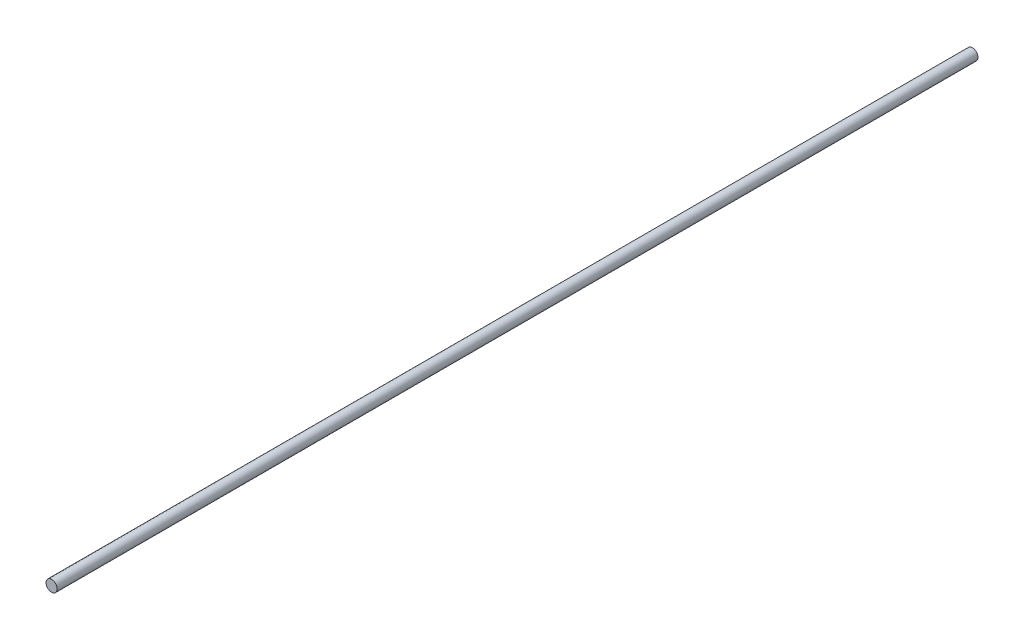
ISO-10303-21;
HEADER;
FILE_DESCRIPTION(('STEP AP214'),'2;1');
FILE_NAME('part.step','',(''),(''),'','','');
FILE_SCHEMA(('AUTOMOTIVE_DESIGN { 1 0 10303 214 1 1 1 1 }'));
ENDSEC;
DATA;
#1=APPLICATION_CONTEXT('core data for automotive mechanical design processes');
#2=APPLICATION_PROTOCOL_DEFINITION('international standard','automotive_design',2000,#1);
#3=PRODUCT_CONTEXT('',#1,'mechanical');
#4=PRODUCT('Part','Part','',(#3));
#5=PRODUCT_RELATED_PRODUCT_CATEGORY('part','',(#4));
#6=PRODUCT_DEFINITION_FORMATION('','',#4);
#7=PRODUCT_DEFINITION_CONTEXT('part definition',#1,'design');
#8=PRODUCT_DEFINITION('design','',#6,#7);
#9=PRODUCT_DEFINITION_SHAPE('','',#8);
#10=(LENGTH_UNIT() NAMED_UNIT(*) SI_UNIT(.MILLI.,.METRE.));
#11=(NAMED_UNIT(*) PLANE_ANGLE_UNIT() SI_UNIT($,.RADIAN.));
#12=(NAMED_UNIT(*) SI_UNIT($,.STERADIAN.) SOLID_ANGLE_UNIT());
#13=UNCERTAINTY_MEASURE_WITH_UNIT(LENGTH_MEASURE(1.E-05),#10,'distance_accuracy_value','');
#14=(GEOMETRIC_REPRESENTATION_CONTEXT(3) GLOBAL_UNCERTAINTY_ASSIGNED_CONTEXT((#13)) GLOBAL_UNIT_ASSIGNED_CONTEXT((#10,
#11,#12)) REPRESENTATION_CONTEXT('',''));
#15=CARTESIAN_POINT('',(0.,0.,0.));
#16=DIRECTION('',(0.,0.,1.));
#17=DIRECTION('',(1.,0.,0.));
#18=AXIS2_PLACEMENT_3D('',#15,#16,#17);
#19=CARTESIAN_POINT('',(0.,0.,330.));
#20=DIRECTION('',(0.,0.,-1.));
#21=DIRECTION('',(-1.,0.,0.));
#22=AXIS2_PLACEMENT_3D('',#19,#20,#21);
#23=CYLINDRICAL_SURFACE('',#22,2.);
#24=CARTESIAN_POINT('',(0.,0.,330.));
#25=DIRECTION('',(0.,0.,1.));
#26=DIRECTION('',(1.,0.,0.));
#27=AXIS2_PLACEMENT_3D('',#24,#25,#26);
#28=CIRCLE('',#27,2.);
#29=CARTESIAN_POINT('',(2.,0.,330.));
#30=VERTEX_POINT('',#29);
#31=EDGE_CURVE('E10',#30,#30,#28,.T.);
#32=ORIENTED_EDGE('',*,*,#31,.F.);
#33=EDGE_LOOP('',(#32));
#34=FACE_BOUND('',#33,.T.);
#35=CARTESIAN_POINT('',(0.,0.,0.));
#36=DIRECTION('',(0.,0.,1.));
#37=DIRECTION('',(1.,0.,0.));
#38=AXIS2_PLACEMENT_3D('',#35,#36,#37);
#39=CIRCLE('',#38,2.);
#40=CARTESIAN_POINT('',(2.,0.,0.));
#41=VERTEX_POINT('',#40);
#42=EDGE_CURVE('E38',#41,#41,#39,.T.);
#43=ORIENTED_EDGE('',*,*,#42,.T.);
#44=EDGE_LOOP('',(#43));
#45=FACE_BOUND('',#44,.T.);
#46=ADVANCED_FACE('F35',(#34,#45),#23,.T.);
#47=CARTESIAN_POINT('',(0.,0.,330.));
#48=DIRECTION('',(0.,0.,1.));
#49=DIRECTION('',(1.,0.,0.));
#50=AXIS2_PLACEMENT_3D('',#47,#48,#49);
#51=PLANE('',#50);
#52=ORIENTED_EDGE('',*,*,#31,.T.);
#53=EDGE_LOOP('',(#52));
#54=FACE_BOUND('',#53,.T.);
#55=ADVANCED_FACE('F50',(#54),#51,.T.);
#56=CARTESIAN_POINT('',(0.,0.,0.));
#57=DIRECTION('',(0.,0.,1.));
#58=DIRECTION('',(1.,0.,0.));
#59=AXIS2_PLACEMENT_3D('',#56,#57,#58);
#60=PLANE('',#59);
#61=ORIENTED_EDGE('',*,*,#42,.F.);
#62=EDGE_LOOP('',(#61));
#63=FACE_BOUND('',#62,.T.);
#64=ADVANCED_FACE('F48',(#63),#60,.F.);
#65=CLOSED_SHELL('',(#46,#55,#64));
#66=MANIFOLD_SOLID_BREP('B2',#65);
#67=ADVANCED_BREP_SHAPE_REPRESENTATION('',(#18,#66),#14);
#68=SHAPE_DEFINITION_REPRESENTATION(#9,#67);
ENDSEC;
END-ISO-10303-21;
